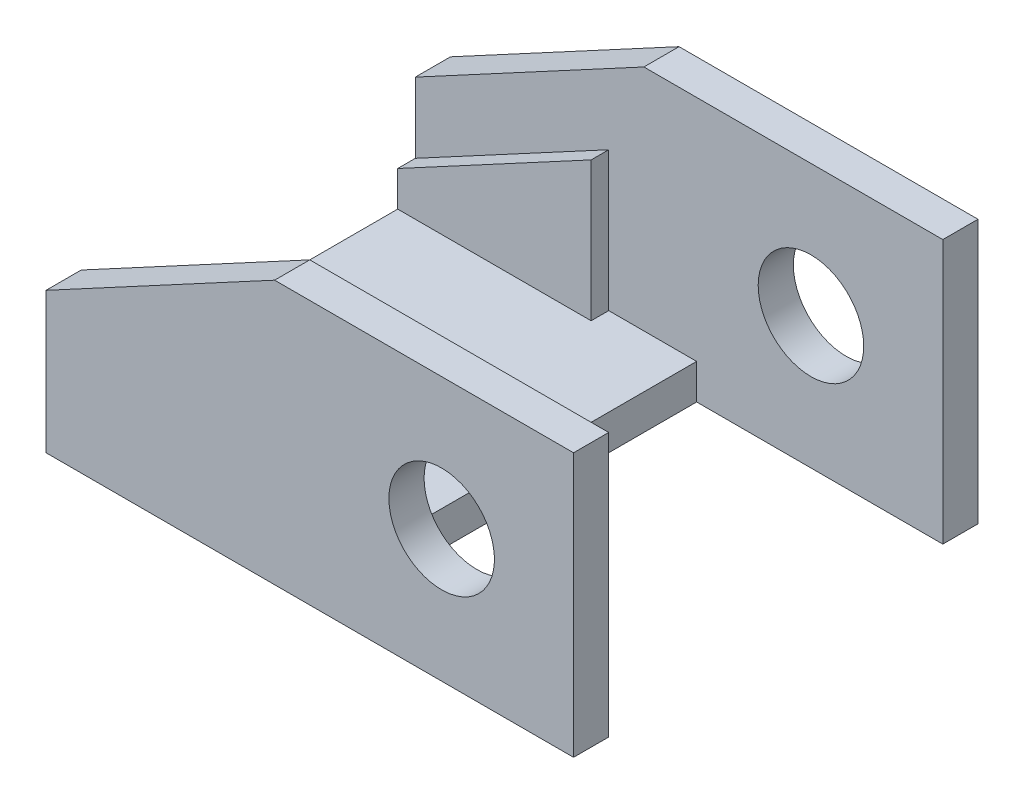
ISO-10303-21;
HEADER;
FILE_DESCRIPTION(('STEP AP214'),'2;1');
FILE_NAME('part.step','',(''),(''),'','','');
FILE_SCHEMA(('AUTOMOTIVE_DESIGN { 1 0 10303 214 1 1 1 1 }'));
ENDSEC;
DATA;
#1=APPLICATION_CONTEXT('core data for automotive mechanical design processes');
#2=APPLICATION_PROTOCOL_DEFINITION('international standard','automotive_design',2000,#1);
#3=PRODUCT_CONTEXT('',#1,'mechanical');
#4=PRODUCT('Part','Part','',(#3));
#5=PRODUCT_RELATED_PRODUCT_CATEGORY('part','',(#4));
#6=PRODUCT_DEFINITION_FORMATION('','',#4);
#7=PRODUCT_DEFINITION_CONTEXT('part definition',#1,'design');
#8=PRODUCT_DEFINITION('design','',#6,#7);
#9=PRODUCT_DEFINITION_SHAPE('','',#8);
#10=(LENGTH_UNIT() NAMED_UNIT(*) SI_UNIT(.MILLI.,.METRE.));
#11=(NAMED_UNIT(*) PLANE_ANGLE_UNIT() SI_UNIT($,.RADIAN.));
#12=(NAMED_UNIT(*) SI_UNIT($,.STERADIAN.) SOLID_ANGLE_UNIT());
#13=UNCERTAINTY_MEASURE_WITH_UNIT(LENGTH_MEASURE(1.E-05),#10,'distance_accuracy_value','');
#14=(GEOMETRIC_REPRESENTATION_CONTEXT(3) GLOBAL_UNCERTAINTY_ASSIGNED_CONTEXT((#13)) GLOBAL_UNIT_ASSIGNED_CONTEXT((#10,
#11,#12)) REPRESENTATION_CONTEXT('',''));
#15=CARTESIAN_POINT('',(0.,0.,0.));
#16=DIRECTION('',(0.,0.,1.));
#17=DIRECTION('',(1.,0.,0.));
#18=AXIS2_PLACEMENT_3D('',#15,#16,#17);
#19=CARTESIAN_POINT('',(8.,15.,-9.5));
#20=DIRECTION('',(0.,0.,1.));
#21=DIRECTION('',(1.,0.,0.));
#22=AXIS2_PLACEMENT_3D('',#19,#20,#21);
#23=PLANE('',#22);
#24=CARTESIAN_POINT('',(14.5,7.5,-9.5));
#25=DIRECTION('',(0.,0.,1.));
#26=DIRECTION('',(1.,0.,0.));
#27=AXIS2_PLACEMENT_3D('',#24,#25,#26);
#28=CIRCLE('',#27,3.);
#29=CARTESIAN_POINT('',(17.5,7.5,-9.5));
#30=VERTEX_POINT('',#29);
#31=EDGE_CURVE('E220',#30,#30,#28,.F.);
#32=ORIENTED_EDGE('',*,*,#31,.T.);
#33=EDGE_LOOP('',(#32));
#34=FACE_BOUND('',#33,.T.);
#35=DIRECTION('',(-0.880471099922175,-0.474099823035017,0.));
#36=VECTOR('',#35,1.);
#37=CARTESIAN_POINT('',(-8.,4.,-9.5));
#38=LINE('',#37,#36);
#39=CARTESIAN_POINT('',(2.99999999999999,9.92307692307692,-9.5));
#40=VERTEX_POINT('',#39);
#41=CARTESIAN_POINT('',(-8.,4.,-9.5));
#42=VERTEX_POINT('',#41);
#43=EDGE_CURVE('E238',#40,#42,#38,.T.);
#44=ORIENTED_EDGE('',*,*,#43,.F.);
#45=DIRECTION('',(0.,1.,0.));
#46=VECTOR('',#45,1.);
#47=CARTESIAN_POINT('',(2.99999999999999,9.92307692307692,-9.5));
#48=LINE('',#47,#46);
#49=CARTESIAN_POINT('',(3.,2.,-9.5));
#50=VERTEX_POINT('',#49);
#51=EDGE_CURVE('E232',#50,#40,#48,.T.);
#52=ORIENTED_EDGE('',*,*,#51,.F.);
#53=DIRECTION('',(-1.,0.,0.));
#54=VECTOR('',#53,1.);
#55=CARTESIAN_POINT('',(-8.,2.,-9.5));
#56=LINE('',#55,#54);
#57=CARTESIAN_POINT('',(8.,2.,-9.5));
#58=VERTEX_POINT('',#57);
#59=EDGE_CURVE('E285',#58,#50,#56,.T.);
#60=ORIENTED_EDGE('',*,*,#59,.F.);
#61=DIRECTION('',(0.,-1.,0.));
#62=VECTOR('',#61,1.);
#63=CARTESIAN_POINT('',(8.,15.,-9.5));
#64=LINE('',#63,#62);
#65=CARTESIAN_POINT('',(8.,0.,-9.5));
#66=VERTEX_POINT('',#65);
#67=EDGE_CURVE('E270',#58,#66,#64,.T.);
#68=ORIENTED_EDGE('',*,*,#67,.T.);
#69=DIRECTION('',(-1.,0.,0.));
#70=VECTOR('',#69,1.);
#71=CARTESIAN_POINT('',(22.,0.,-9.5));
#72=LINE('',#71,#70);
#73=CARTESIAN_POINT('',(22.,0.,-9.5));
#74=VERTEX_POINT('',#73);
#75=EDGE_CURVE('E264',#74,#66,#72,.T.);
#76=ORIENTED_EDGE('',*,*,#75,.F.);
#77=DIRECTION('',(0.,-1.,0.));
#78=VECTOR('',#77,1.);
#79=CARTESIAN_POINT('',(22.,15.,-9.5));
#80=LINE('',#79,#78);
#81=CARTESIAN_POINT('',(22.,15.,-9.5));
#82=VERTEX_POINT('',#81);
#83=EDGE_CURVE('E259',#82,#74,#80,.T.);
#84=ORIENTED_EDGE('',*,*,#83,.F.);
#85=DIRECTION('',(-1.,0.,0.));
#86=VECTOR('',#85,1.);
#87=CARTESIAN_POINT('',(8.,15.,-9.5));
#88=LINE('',#87,#86);
#89=CARTESIAN_POINT('',(5.,15.,-9.5));
#90=VERTEX_POINT('',#89);
#91=EDGE_CURVE('E307',#82,#90,#88,.T.);
#92=ORIENTED_EDGE('',*,*,#91,.T.);
#93=DIRECTION('',(-0.880471099922175,-0.474099823035017,0.));
#94=VECTOR('',#93,1.);
#95=CARTESIAN_POINT('',(7.32568807339449,16.2522935779816,-9.5));
#96=LINE('',#95,#94);
#97=CARTESIAN_POINT('',(-8.,8.,-9.50000000000001));
#98=VERTEX_POINT('',#97);
#99=EDGE_CURVE('E56',#90,#98,#96,.T.);
#100=ORIENTED_EDGE('',*,*,#99,.T.);
#101=DIRECTION('',(0.,-1.,0.));
#102=VECTOR('',#101,1.);
#103=CARTESIAN_POINT('',(-8.,15.,-9.5));
#104=LINE('',#103,#102);
#105=EDGE_CURVE('E298',#98,#42,#104,.T.);
#106=ORIENTED_EDGE('',*,*,#105,.T.);
#107=EDGE_LOOP('',(#44,#52,#60,#68,#76,#84,#92,#100,#106));
#108=FACE_BOUND('',#107,.T.);
#109=ADVANCED_FACE('F33',(#34,#108),#23,.T.);
#110=CARTESIAN_POINT('',(0.,2.,0.));
#111=DIRECTION('',(0.,1.,0.));
#112=DIRECTION('',(0.,0.,1.));
#113=AXIS2_PLACEMENT_3D('',#110,#111,#112);
#114=PLANE('',#113);
#115=CARTESIAN_POINT('',(4.,2.,0.));
#116=DIRECTION('',(0.,1.,0.));
#117=DIRECTION('',(0.,0.,1.));
#118=AXIS2_PLACEMENT_3D('',#115,#116,#117);
#119=CIRCLE('',#118,2.5);
#120=CARTESIAN_POINT('',(4.,2.,2.5));
#121=VERTEX_POINT('',#120);
#122=EDGE_CURVE('E41',#121,#121,#119,.F.);
#123=ORIENTED_EDGE('',*,*,#122,.T.);
#124=EDGE_LOOP('',(#123));
#125=FACE_BOUND('',#124,.T.);
#126=CARTESIAN_POINT('',(-4.,2.,0.));
#127=DIRECTION('',(0.,1.,0.));
#128=DIRECTION('',(0.,0.,1.));
#129=AXIS2_PLACEMENT_3D('',#126,#127,#128);
#130=CIRCLE('',#129,2.50000000000001);
#131=CARTESIAN_POINT('',(-4.,2.,2.50000000000001));
#132=VERTEX_POINT('',#131);
#133=EDGE_CURVE('E447',#132,#132,#130,.F.);
#134=ORIENTED_EDGE('',*,*,#133,.T.);
#135=EDGE_LOOP('',(#134));
#136=FACE_BOUND('',#135,.T.);
#137=ORIENTED_EDGE('',*,*,#59,.T.);
#138=DIRECTION('',(0.,0.,-1.));
#139=VECTOR('',#138,1.);
#140=CARTESIAN_POINT('',(3.,2.,-8.5));
#141=LINE('',#140,#139);
#142=CARTESIAN_POINT('',(3.,2.,-8.5));
#143=VERTEX_POINT('',#142);
#144=EDGE_CURVE('E251',#143,#50,#141,.T.);
#145=ORIENTED_EDGE('',*,*,#144,.F.);
#146=DIRECTION('',(1.,0.,0.));
#147=VECTOR('',#146,1.);
#148=CARTESIAN_POINT('',(3.,2.,-8.5));
#149=LINE('',#148,#147);
#150=CARTESIAN_POINT('',(-8.,2.,-8.5));
#151=VERTEX_POINT('',#150);
#152=EDGE_CURVE('E235',#151,#143,#149,.T.);
#153=ORIENTED_EDGE('',*,*,#152,.F.);
#154=DIRECTION('',(0.,0.,1.));
#155=VECTOR('',#154,1.);
#156=CARTESIAN_POINT('',(-8.,2.,-9.5));
#157=LINE('',#156,#155);
#158=CARTESIAN_POINT('',(-8.,2.,8.5));
#159=VERTEX_POINT('',#158);
#160=EDGE_CURVE('E183',#151,#159,#157,.T.);
#161=ORIENTED_EDGE('',*,*,#160,.T.);
#162=DIRECTION('',(1.,0.,0.));
#163=VECTOR('',#162,1.);
#164=CARTESIAN_POINT('',(3.,2.,8.5));
#165=LINE('',#164,#163);
#166=CARTESIAN_POINT('',(3.,2.,8.5));
#167=VERTEX_POINT('',#166);
#168=EDGE_CURVE('E164',#159,#167,#165,.T.);
#169=ORIENTED_EDGE('',*,*,#168,.T.);
#170=DIRECTION('',(0.,0.,1.));
#171=VECTOR('',#170,1.);
#172=CARTESIAN_POINT('',(3.,2.,8.5));
#173=LINE('',#172,#171);
#174=CARTESIAN_POINT('',(3.,2.,9.5));
#175=VERTEX_POINT('',#174);
#176=EDGE_CURVE('E170',#167,#175,#173,.T.);
#177=ORIENTED_EDGE('',*,*,#176,.T.);
#178=DIRECTION('',(-1.,0.,0.));
#179=VECTOR('',#178,1.);
#180=CARTESIAN_POINT('',(-8.,2.,9.5));
#181=LINE('',#180,#179);
#182=CARTESIAN_POINT('',(8.,2.,9.5));
#183=VERTEX_POINT('',#182);
#184=EDGE_CURVE('E356',#183,#175,#181,.T.);
#185=ORIENTED_EDGE('',*,*,#184,.F.);
#186=DIRECTION('',(0.,0.,-1.));
#187=VECTOR('',#186,1.);
#188=CARTESIAN_POINT('',(8.,2.,-9.5));
#189=LINE('',#188,#187);
#190=EDGE_CURVE('E292',#183,#58,#189,.T.);
#191=ORIENTED_EDGE('',*,*,#190,.T.);
#192=EDGE_LOOP('',(#137,#145,#153,#161,#169,#177,#185,#191));
#193=FACE_BOUND('',#192,.T.);
#194=ADVANCED_FACE('F181',(#125,#136,#193),#114,.T.);
#195=CARTESIAN_POINT('',(8.,2.,-9.5));
#196=DIRECTION('',(-1.,0.,0.));
#197=DIRECTION('',(0.,0.,1.));
#198=AXIS2_PLACEMENT_3D('',#195,#196,#197);
#199=PLANE('',#198);
#200=ORIENTED_EDGE('',*,*,#67,.F.);
#201=ORIENTED_EDGE('',*,*,#190,.F.);
#202=DIRECTION('',(0.,-1.,0.));
#203=VECTOR('',#202,1.);
#204=CARTESIAN_POINT('',(8.,15.,9.5));
#205=LINE('',#204,#203);
#206=CARTESIAN_POINT('',(8.,0.,9.5));
#207=VERTEX_POINT('',#206);
#208=EDGE_CURVE('E216',#183,#207,#205,.T.);
#209=ORIENTED_EDGE('',*,*,#208,.T.);
#210=DIRECTION('',(0.,0.,-1.));
#211=VECTOR('',#210,1.);
#212=CARTESIAN_POINT('',(8.,0.,-9.5));
#213=LINE('',#212,#211);
#214=EDGE_CURVE('E276',#207,#66,#213,.T.);
#215=ORIENTED_EDGE('',*,*,#214,.T.);
#216=EDGE_LOOP('',(#200,#201,#209,#215));
#217=FACE_BOUND('',#216,.T.);
#218=ADVANCED_FACE('F315',(#217),#199,.F.);
#219=CARTESIAN_POINT('',(-8.,2.,-9.5));
#220=DIRECTION('',(1.,0.,0.));
#221=DIRECTION('',(0.,0.,-1.));
#222=AXIS2_PLACEMENT_3D('',#219,#220,#221);
#223=PLANE('',#222);
#224=DIRECTION('',(0.,0.,1.));
#225=VECTOR('',#224,1.);
#226=CARTESIAN_POINT('',(-8.,8.,-42.4549704462802));
#227=LINE('',#226,#225);
#228=CARTESIAN_POINT('',(-8.,8.,-11.5));
#229=VERTEX_POINT('',#228);
#230=EDGE_CURVE('E267',#229,#98,#227,.T.);
#231=ORIENTED_EDGE('',*,*,#230,.F.);
#232=DIRECTION('',(0.,-1.,0.));
#233=VECTOR('',#232,1.);
#234=CARTESIAN_POINT('',(-8.,15.,-11.5));
#235=LINE('',#234,#233);
#236=CARTESIAN_POINT('',(-8.,0.,-11.5));
#237=VERTEX_POINT('',#236);
#238=EDGE_CURVE('E301',#229,#237,#235,.T.);
#239=ORIENTED_EDGE('',*,*,#238,.T.);
#240=DIRECTION('',(0.,0.,1.));
#241=VECTOR('',#240,1.);
#242=CARTESIAN_POINT('',(-8.,0.,-9.5));
#243=LINE('',#242,#241);
#244=CARTESIAN_POINT('',(-8.,0.,11.5));
#245=VERTEX_POINT('',#244);
#246=EDGE_CURVE('E295',#237,#245,#243,.T.);
#247=ORIENTED_EDGE('',*,*,#246,.T.);
#248=DIRECTION('',(0.,-1.,0.));
#249=VECTOR('',#248,1.);
#250=CARTESIAN_POINT('',(-8.,15.,11.5));
#251=LINE('',#250,#249);
#252=CARTESIAN_POINT('',(-8.,8.,11.5));
#253=VERTEX_POINT('',#252);
#254=EDGE_CURVE('E372',#253,#245,#251,.T.);
#255=ORIENTED_EDGE('',*,*,#254,.F.);
#256=DIRECTION('',(0.,0.,-1.));
#257=VECTOR('',#256,1.);
#258=CARTESIAN_POINT('',(-8.,8.,42.4549704462802));
#259=LINE('',#258,#257);
#260=CARTESIAN_POINT('',(-8.,8.,9.50000000000001));
#261=VERTEX_POINT('',#260);
#262=EDGE_CURVE('E213',#253,#261,#259,.T.);
#263=ORIENTED_EDGE('',*,*,#262,.T.);
#264=DIRECTION('',(0.,-1.,0.));
#265=VECTOR('',#264,1.);
#266=CARTESIAN_POINT('',(-8.,15.,9.5));
#267=LINE('',#266,#265);
#268=CARTESIAN_POINT('',(-8.,4.,9.5));
#269=VERTEX_POINT('',#268);
#270=EDGE_CURVE('E222',#261,#269,#267,.T.);
#271=ORIENTED_EDGE('',*,*,#270,.T.);
#272=DIRECTION('',(0.,0.,1.));
#273=VECTOR('',#272,1.);
#274=CARTESIAN_POINT('',(-8.,4.,8.5));
#275=LINE('',#274,#273);
#276=CARTESIAN_POINT('',(-8.,4.,8.5));
#277=VERTEX_POINT('',#276);
#278=EDGE_CURVE('E196',#277,#269,#275,.T.);
#279=ORIENTED_EDGE('',*,*,#278,.F.);
#280=DIRECTION('',(0.,-1.,0.));
#281=VECTOR('',#280,1.);
#282=CARTESIAN_POINT('',(-8.,2.,8.5));
#283=LINE('',#282,#281);
#284=EDGE_CURVE('E194',#277,#159,#283,.T.);
#285=ORIENTED_EDGE('',*,*,#284,.T.);
#286=ORIENTED_EDGE('',*,*,#160,.F.);
#287=DIRECTION('',(0.,-1.,0.));
#288=VECTOR('',#287,1.);
#289=CARTESIAN_POINT('',(-8.,2.,-8.5));
#290=LINE('',#289,#288);
#291=CARTESIAN_POINT('',(-8.,4.,-8.5));
#292=VERTEX_POINT('',#291);
#293=EDGE_CURVE('E48',#292,#151,#290,.T.);
#294=ORIENTED_EDGE('',*,*,#293,.F.);
#295=DIRECTION('',(0.,0.,-1.));
#296=VECTOR('',#295,1.);
#297=CARTESIAN_POINT('',(-8.,4.,-8.5));
#298=LINE('',#297,#296);
#299=EDGE_CURVE('E243',#292,#42,#298,.T.);
#300=ORIENTED_EDGE('',*,*,#299,.T.);
#301=ORIENTED_EDGE('',*,*,#105,.F.);
#302=EDGE_LOOP('',(#231,#239,#247,#255,#263,#271,#279,#285,#286,#294,#300,#301));
#303=FACE_BOUND('',#302,.T.);
#304=ADVANCED_FACE('F347',(#303),#223,.F.);
#305=CARTESIAN_POINT('',(8.,15.,-11.5));
#306=DIRECTION('',(0.,0.,-1.));
#307=DIRECTION('',(-1.,0.,0.));
#308=AXIS2_PLACEMENT_3D('',#305,#306,#307);
#309=PLANE('',#308);
#310=CARTESIAN_POINT('',(14.5,7.5,-11.5));
#311=DIRECTION('',(0.,0.,-1.));
#312=DIRECTION('',(-1.,0.,0.));
#313=AXIS2_PLACEMENT_3D('',#310,#311,#312);
#314=CIRCLE('',#313,3.);
#315=CARTESIAN_POINT('',(11.5,7.5,-11.5));
#316=VERTEX_POINT('',#315);
#317=EDGE_CURVE('E229',#316,#316,#314,.T.);
#318=ORIENTED_EDGE('',*,*,#317,.F.);
#319=EDGE_LOOP('',(#318));
#320=FACE_BOUND('',#319,.T.);
#321=ORIENTED_EDGE('',*,*,#238,.F.);
#322=DIRECTION('',(0.880471099922175,0.474099823035017,0.));
#323=VECTOR('',#322,1.);
#324=CARTESIAN_POINT('',(7.3256880733945,16.2522935779816,-11.5));
#325=LINE('',#324,#323);
#326=CARTESIAN_POINT('',(5.,15.,-11.5));
#327=VERTEX_POINT('',#326);
#328=EDGE_CURVE('E338',#229,#327,#325,.T.);
#329=ORIENTED_EDGE('',*,*,#328,.T.);
#330=DIRECTION('',(1.,0.,0.));
#331=VECTOR('',#330,1.);
#332=CARTESIAN_POINT('',(8.,15.,-11.5));
#333=LINE('',#332,#331);
#334=CARTESIAN_POINT('',(22.,15.,-11.5));
#335=VERTEX_POINT('',#334);
#336=EDGE_CURVE('E336',#327,#335,#333,.T.);
#337=ORIENTED_EDGE('',*,*,#336,.T.);
#338=DIRECTION('',(0.,1.,0.));
#339=VECTOR('',#338,1.);
#340=CARTESIAN_POINT('',(22.,15.,-11.5));
#341=LINE('',#340,#339);
#342=CARTESIAN_POINT('',(22.,0.,-11.5));
#343=VERTEX_POINT('',#342);
#344=EDGE_CURVE('E253',#343,#335,#341,.T.);
#345=ORIENTED_EDGE('',*,*,#344,.F.);
#346=DIRECTION('',(1.,0.,0.));
#347=VECTOR('',#346,1.);
#348=CARTESIAN_POINT('',(8.,0.,-11.5));
#349=LINE('',#348,#347);
#350=EDGE_CURVE('E305',#237,#343,#349,.T.);
#351=ORIENTED_EDGE('',*,*,#350,.F.);
#352=EDGE_LOOP('',(#321,#329,#337,#345,#351));
#353=FACE_BOUND('',#352,.T.);
#354=ADVANCED_FACE('F333',(#320,#353),#309,.T.);
#355=CARTESIAN_POINT('',(0.,15.,0.));
#356=DIRECTION('',(0.,1.,0.));
#357=DIRECTION('',(0.,0.,1.));
#358=AXIS2_PLACEMENT_3D('',#355,#356,#357);
#359=PLANE('',#358);
#360=ORIENTED_EDGE('',*,*,#336,.F.);
#361=DIRECTION('',(0.,0.,1.));
#362=VECTOR('',#361,1.);
#363=CARTESIAN_POINT('',(5.,15.,0.));
#364=LINE('',#363,#362);
#365=EDGE_CURVE('E275',#327,#90,#364,.T.);
#366=ORIENTED_EDGE('',*,*,#365,.T.);
#367=ORIENTED_EDGE('',*,*,#91,.F.);
#368=DIRECTION('',(0.,0.,1.));
#369=VECTOR('',#368,1.);
#370=CARTESIAN_POINT('',(22.,15.,-9.5));
#371=LINE('',#370,#369);
#372=EDGE_CURVE('E256',#335,#82,#371,.T.);
#373=ORIENTED_EDGE('',*,*,#372,.F.);
#374=EDGE_LOOP('',(#360,#366,#367,#373));
#375=FACE_BOUND('',#374,.T.);
#376=ADVANCED_FACE('F341',(#375),#359,.T.);
#377=CARTESIAN_POINT('',(0.,0.,0.));
#378=DIRECTION('',(0.,1.,0.));
#379=DIRECTION('',(0.,0.,1.));
#380=AXIS2_PLACEMENT_3D('',#377,#378,#379);
#381=PLANE('',#380);
#382=CARTESIAN_POINT('',(4.,0.,0.));
#383=DIRECTION('',(0.,1.,0.));
#384=DIRECTION('',(0.,0.,1.));
#385=AXIS2_PLACEMENT_3D('',#382,#383,#384);
#386=CIRCLE('',#385,1.5);
#387=CARTESIAN_POINT('',(4.,0.,1.5));
#388=VERTEX_POINT('',#387);
#389=EDGE_CURVE('E461',#388,#388,#386,.F.);
#390=ORIENTED_EDGE('',*,*,#389,.F.);
#391=EDGE_LOOP('',(#390));
#392=FACE_BOUND('',#391,.T.);
#393=CARTESIAN_POINT('',(-4.,0.,0.));
#394=DIRECTION('',(0.,1.,0.));
#395=DIRECTION('',(0.,0.,1.));
#396=AXIS2_PLACEMENT_3D('',#393,#394,#395);
#397=CIRCLE('',#396,1.5);
#398=CARTESIAN_POINT('',(-4.,0.,1.5));
#399=VERTEX_POINT('',#398);
#400=EDGE_CURVE('E459',#399,#399,#397,.F.);
#401=ORIENTED_EDGE('',*,*,#400,.F.);
#402=EDGE_LOOP('',(#401));
#403=FACE_BOUND('',#402,.T.);
#404=ORIENTED_EDGE('',*,*,#214,.F.);
#405=DIRECTION('',(-1.,0.,0.));
#406=VECTOR('',#405,1.);
#407=CARTESIAN_POINT('',(22.,0.,9.5));
#408=LINE('',#407,#406);
#409=CARTESIAN_POINT('',(22.,0.,9.5));
#410=VERTEX_POINT('',#409);
#411=EDGE_CURVE('E210',#410,#207,#408,.T.);
#412=ORIENTED_EDGE('',*,*,#411,.F.);
#413=DIRECTION('',(0.,0.,1.));
#414=VECTOR('',#413,1.);
#415=CARTESIAN_POINT('',(22.,0.,9.5));
#416=LINE('',#415,#414);
#417=CARTESIAN_POINT('',(22.,0.,11.5));
#418=VERTEX_POINT('',#417);
#419=EDGE_CURVE('E208',#410,#418,#416,.T.);
#420=ORIENTED_EDGE('',*,*,#419,.T.);
#421=DIRECTION('',(1.,0.,0.));
#422=VECTOR('',#421,1.);
#423=CARTESIAN_POINT('',(8.,0.,11.5));
#424=LINE('',#423,#422);
#425=EDGE_CURVE('E364',#245,#418,#424,.T.);
#426=ORIENTED_EDGE('',*,*,#425,.F.);
#427=ORIENTED_EDGE('',*,*,#246,.F.);
#428=ORIENTED_EDGE('',*,*,#350,.T.);
#429=DIRECTION('',(0.,0.,-1.));
#430=VECTOR('',#429,1.);
#431=CARTESIAN_POINT('',(22.,0.,-9.5));
#432=LINE('',#431,#430);
#433=EDGE_CURVE('E261',#74,#343,#432,.T.);
#434=ORIENTED_EDGE('',*,*,#433,.F.);
#435=ORIENTED_EDGE('',*,*,#75,.T.);
#436=EDGE_LOOP('',(#404,#412,#420,#426,#427,#428,#434,#435));
#437=FACE_BOUND('',#436,.T.);
#438=ADVANCED_FACE('F326',(#392,#403,#437),#381,.F.);
#439=CARTESIAN_POINT('',(5.,15.,-42.4549704462802));
#440=DIRECTION('',(-0.474099823035017,0.880471099922175,0.));
#441=DIRECTION('',(-0.880471099922175,-0.474099823035017,0.));
#442=AXIS2_PLACEMENT_3D('',#439,#440,#441);
#443=PLANE('',#442);
#444=ORIENTED_EDGE('',*,*,#99,.F.);
#445=ORIENTED_EDGE('',*,*,#365,.F.);
#446=ORIENTED_EDGE('',*,*,#328,.F.);
#447=ORIENTED_EDGE('',*,*,#230,.T.);
#448=EDGE_LOOP('',(#444,#445,#446,#447));
#449=FACE_BOUND('',#448,.T.);
#450=ADVANCED_FACE('F346',(#449),#443,.T.);
#451=CARTESIAN_POINT('',(22.,0.,0.));
#452=DIRECTION('',(1.,0.,0.));
#453=DIRECTION('',(0.,0.,-1.));
#454=AXIS2_PLACEMENT_3D('',#451,#452,#453);
#455=PLANE('',#454);
#456=ORIENTED_EDGE('',*,*,#344,.T.);
#457=ORIENTED_EDGE('',*,*,#372,.T.);
#458=ORIENTED_EDGE('',*,*,#83,.T.);
#459=ORIENTED_EDGE('',*,*,#433,.T.);
#460=EDGE_LOOP('',(#456,#457,#458,#459));
#461=FACE_BOUND('',#460,.T.);
#462=ADVANCED_FACE('F330',(#461),#455,.T.);
#463=CARTESIAN_POINT('',(2.99999999999999,9.92307692307692,-8.5));
#464=DIRECTION('',(-1.,0.,0.));
#465=DIRECTION('',(0.,-1.,0.));
#466=AXIS2_PLACEMENT_3D('',#463,#464,#465);
#467=PLANE('',#466);
#468=ORIENTED_EDGE('',*,*,#51,.T.);
#469=DIRECTION('',(0.,0.,-1.));
#470=VECTOR('',#469,1.);
#471=CARTESIAN_POINT('',(2.99999999999999,9.92307692307692,-8.5));
#472=LINE('',#471,#470);
#473=CARTESIAN_POINT('',(2.99999999999999,9.92307692307692,-8.5));
#474=VERTEX_POINT('',#473);
#475=EDGE_CURVE('E248',#474,#40,#472,.T.);
#476=ORIENTED_EDGE('',*,*,#475,.F.);
#477=DIRECTION('',(0.,1.,0.));
#478=VECTOR('',#477,1.);
#479=CARTESIAN_POINT('',(2.99999999999999,9.92307692307692,-8.5));
#480=LINE('',#479,#478);
#481=EDGE_CURVE('E237',#143,#474,#480,.T.);
#482=ORIENTED_EDGE('',*,*,#481,.F.);
#483=ORIENTED_EDGE('',*,*,#144,.T.);
#484=EDGE_LOOP('',(#468,#476,#482,#483));
#485=FACE_BOUND('',#484,.T.);
#486=ADVANCED_FACE('F354',(#485),#467,.F.);
#487=CARTESIAN_POINT('',(-8.,4.,-8.5));
#488=DIRECTION('',(0.474099823035017,-0.880471099922175,0.));
#489=DIRECTION('',(0.880471099922175,0.474099823035018,0.));
#490=AXIS2_PLACEMENT_3D('',#487,#488,#489);
#491=PLANE('',#490);
#492=ORIENTED_EDGE('',*,*,#43,.T.);
#493=ORIENTED_EDGE('',*,*,#299,.F.);
#494=DIRECTION('',(-0.880471099922175,-0.474099823035017,0.));
#495=VECTOR('',#494,1.);
#496=CARTESIAN_POINT('',(-8.,4.,-8.5));
#497=LINE('',#496,#495);
#498=EDGE_CURVE('E240',#474,#292,#497,.T.);
#499=ORIENTED_EDGE('',*,*,#498,.F.);
#500=ORIENTED_EDGE('',*,*,#475,.T.);
#501=EDGE_LOOP('',(#492,#493,#499,#500));
#502=FACE_BOUND('',#501,.T.);
#503=ADVANCED_FACE('F350',(#502),#491,.F.);
#504=CARTESIAN_POINT('',(0.,0.,-8.5));
#505=DIRECTION('',(0.,0.,-1.));
#506=DIRECTION('',(-1.,0.,0.));
#507=AXIS2_PLACEMENT_3D('',#504,#505,#506);
#508=PLANE('',#507);
#509=ORIENTED_EDGE('',*,*,#152,.T.);
#510=ORIENTED_EDGE('',*,*,#481,.T.);
#511=ORIENTED_EDGE('',*,*,#498,.T.);
#512=ORIENTED_EDGE('',*,*,#293,.T.);
#513=EDGE_LOOP('',(#509,#510,#511,#512));
#514=FACE_BOUND('',#513,.T.);
#515=ADVANCED_FACE('F485',(#514),#508,.F.);
#516=CARTESIAN_POINT('',(14.5,7.5,0.00102500000000172));
#517=DIRECTION('',(0.,0.,-1.));
#518=DIRECTION('',(-1.,0.,0.));
#519=AXIS2_PLACEMENT_3D('',#516,#517,#518);
#520=CYLINDRICAL_SURFACE('',#519,3.);
#521=ORIENTED_EDGE('',*,*,#31,.F.);
#522=EDGE_LOOP('',(#521));
#523=FACE_BOUND('',#522,.T.);
#524=ORIENTED_EDGE('',*,*,#317,.T.);
#525=EDGE_LOOP('',(#524));
#526=FACE_BOUND('',#525,.T.);
#527=ADVANCED_FACE('F478',(#523,#526),#520,.F.);
#528=CARTESIAN_POINT('',(8.,15.,9.5));
#529=DIRECTION('',(0.,0.,-1.));
#530=DIRECTION('',(1.,0.,0.));
#531=AXIS2_PLACEMENT_3D('',#528,#529,#530);
#532=PLANE('',#531);
#533=CARTESIAN_POINT('',(14.5,7.5,9.5));
#534=DIRECTION('',(0.,0.,1.));
#535=DIRECTION('',(1.,0.,0.));
#536=AXIS2_PLACEMENT_3D('',#533,#534,#535);
#537=CIRCLE('',#536,3.);
#538=CARTESIAN_POINT('',(17.5,7.5,9.5));
#539=VERTEX_POINT('',#538);
#540=EDGE_CURVE('E190',#539,#539,#537,.F.);
#541=ORIENTED_EDGE('',*,*,#540,.F.);
#542=EDGE_LOOP('',(#541));
#543=FACE_BOUND('',#542,.T.);
#544=DIRECTION('',(-0.880471099922175,-0.474099823035017,0.));
#545=VECTOR('',#544,1.);
#546=CARTESIAN_POINT('',(-8.,4.,9.5));
#547=LINE('',#546,#545);
#548=CARTESIAN_POINT('',(2.99999999999999,9.92307692307692,9.5));
#549=VERTEX_POINT('',#548);
#550=EDGE_CURVE('E185',#549,#269,#547,.T.);
#551=ORIENTED_EDGE('',*,*,#550,.T.);
#552=ORIENTED_EDGE('',*,*,#270,.F.);
#553=DIRECTION('',(-0.880471099922175,-0.474099823035017,0.));
#554=VECTOR('',#553,1.);
#555=CARTESIAN_POINT('',(7.32568807339449,16.2522935779816,9.5));
#556=LINE('',#555,#554);
#557=CARTESIAN_POINT('',(5.,15.,9.5));
#558=VERTEX_POINT('',#557);
#559=EDGE_CURVE('E374',#558,#261,#556,.T.);
#560=ORIENTED_EDGE('',*,*,#559,.F.);
#561=DIRECTION('',(-1.,0.,0.));
#562=VECTOR('',#561,1.);
#563=CARTESIAN_POINT('',(8.,15.,9.5));
#564=LINE('',#563,#562);
#565=CARTESIAN_POINT('',(22.,15.,9.5));
#566=VERTEX_POINT('',#565);
#567=EDGE_CURVE('E376',#566,#558,#564,.T.);
#568=ORIENTED_EDGE('',*,*,#567,.F.);
#569=DIRECTION('',(0.,-1.,0.));
#570=VECTOR('',#569,1.);
#571=CARTESIAN_POINT('',(22.,15.,9.5));
#572=LINE('',#571,#570);
#573=EDGE_CURVE('E205',#566,#410,#572,.T.);
#574=ORIENTED_EDGE('',*,*,#573,.T.);
#575=ORIENTED_EDGE('',*,*,#411,.T.);
#576=ORIENTED_EDGE('',*,*,#208,.F.);
#577=ORIENTED_EDGE('',*,*,#184,.T.);
#578=DIRECTION('',(0.,1.,0.));
#579=VECTOR('',#578,1.);
#580=CARTESIAN_POINT('',(2.99999999999999,9.92307692307692,9.5));
#581=LINE('',#580,#579);
#582=EDGE_CURVE('E173',#175,#549,#581,.T.);
#583=ORIENTED_EDGE('',*,*,#582,.T.);
#584=EDGE_LOOP('',(#551,#552,#560,#568,#574,#575,#576,#577,#583));
#585=FACE_BOUND('',#584,.T.);
#586=ADVANCED_FACE('F359',(#543,#585),#532,.T.);
#587=CARTESIAN_POINT('',(8.,15.,11.5));
#588=DIRECTION('',(0.,0.,1.));
#589=DIRECTION('',(-1.,0.,0.));
#590=AXIS2_PLACEMENT_3D('',#587,#588,#589);
#591=PLANE('',#590);
#592=CARTESIAN_POINT('',(14.5,7.5,11.5));
#593=DIRECTION('',(0.,0.,-1.));
#594=DIRECTION('',(-1.,0.,0.));
#595=AXIS2_PLACEMENT_3D('',#592,#593,#594);
#596=CIRCLE('',#595,3.);
#597=CARTESIAN_POINT('',(11.5,7.5,11.5));
#598=VERTEX_POINT('',#597);
#599=EDGE_CURVE('E197',#598,#598,#596,.T.);
#600=ORIENTED_EDGE('',*,*,#599,.T.);
#601=EDGE_LOOP('',(#600));
#602=FACE_BOUND('',#601,.T.);
#603=ORIENTED_EDGE('',*,*,#254,.T.);
#604=ORIENTED_EDGE('',*,*,#425,.T.);
#605=DIRECTION('',(0.,1.,0.));
#606=VECTOR('',#605,1.);
#607=CARTESIAN_POINT('',(22.,15.,11.5));
#608=LINE('',#607,#606);
#609=CARTESIAN_POINT('',(22.,15.,11.5));
#610=VERTEX_POINT('',#609);
#611=EDGE_CURVE('E177',#418,#610,#608,.T.);
#612=ORIENTED_EDGE('',*,*,#611,.T.);
#613=DIRECTION('',(1.,0.,0.));
#614=VECTOR('',#613,1.);
#615=CARTESIAN_POINT('',(8.,15.,11.5));
#616=LINE('',#615,#614);
#617=CARTESIAN_POINT('',(5.,15.,11.5));
#618=VERTEX_POINT('',#617);
#619=EDGE_CURVE('E373',#618,#610,#616,.T.);
#620=ORIENTED_EDGE('',*,*,#619,.F.);
#621=DIRECTION('',(0.880471099922175,0.474099823035017,0.));
#622=VECTOR('',#621,1.);
#623=CARTESIAN_POINT('',(7.3256880733945,16.2522935779816,11.5));
#624=LINE('',#623,#622);
#625=EDGE_CURVE('E379',#253,#618,#624,.T.);
#626=ORIENTED_EDGE('',*,*,#625,.F.);
#627=EDGE_LOOP('',(#603,#604,#612,#620,#626));
#628=FACE_BOUND('',#627,.T.);
#629=ADVANCED_FACE('F371',(#602,#628),#591,.T.);
#630=CARTESIAN_POINT('',(0.,15.,0.));
#631=DIRECTION('',(0.,1.,0.));
#632=DIRECTION('',(0.,0.,-1.));
#633=AXIS2_PLACEMENT_3D('',#630,#631,#632);
#634=PLANE('',#633);
#635=ORIENTED_EDGE('',*,*,#619,.T.);
#636=DIRECTION('',(0.,0.,-1.));
#637=VECTOR('',#636,1.);
#638=CARTESIAN_POINT('',(22.,15.,9.5));
#639=LINE('',#638,#637);
#640=EDGE_CURVE('E203',#610,#566,#639,.T.);
#641=ORIENTED_EDGE('',*,*,#640,.T.);
#642=ORIENTED_EDGE('',*,*,#567,.T.);
#643=DIRECTION('',(0.,0.,-1.));
#644=VECTOR('',#643,1.);
#645=CARTESIAN_POINT('',(5.,15.,0.));
#646=LINE('',#645,#644);
#647=EDGE_CURVE('E221',#618,#558,#646,.T.);
#648=ORIENTED_EDGE('',*,*,#647,.F.);
#649=EDGE_LOOP('',(#635,#641,#642,#648));
#650=FACE_BOUND('',#649,.T.);
#651=ADVANCED_FACE('F394',(#650),#634,.T.);
#652=CARTESIAN_POINT('',(5.,15.,42.4549704462802));
#653=DIRECTION('',(-0.474099823035017,0.880471099922175,0.));
#654=DIRECTION('',(-0.880471099922175,-0.474099823035017,0.));
#655=AXIS2_PLACEMENT_3D('',#652,#653,#654);
#656=PLANE('',#655);
#657=ORIENTED_EDGE('',*,*,#559,.T.);
#658=ORIENTED_EDGE('',*,*,#262,.F.);
#659=ORIENTED_EDGE('',*,*,#625,.T.);
#660=ORIENTED_EDGE('',*,*,#647,.T.);
#661=EDGE_LOOP('',(#657,#658,#659,#660));
#662=FACE_BOUND('',#661,.T.);
#663=ADVANCED_FACE('F389',(#662),#656,.T.);
#664=CARTESIAN_POINT('',(22.,0.,0.));
#665=DIRECTION('',(1.,0.,0.));
#666=DIRECTION('',(0.,0.,1.));
#667=AXIS2_PLACEMENT_3D('',#664,#665,#666);
#668=PLANE('',#667);
#669=ORIENTED_EDGE('',*,*,#611,.F.);
#670=ORIENTED_EDGE('',*,*,#419,.F.);
#671=ORIENTED_EDGE('',*,*,#573,.F.);
#672=ORIENTED_EDGE('',*,*,#640,.F.);
#673=EDGE_LOOP('',(#669,#670,#671,#672));
#674=FACE_BOUND('',#673,.T.);
#675=ADVANCED_FACE('F367',(#674),#668,.T.);
#676=CARTESIAN_POINT('',(2.99999999999999,9.92307692307692,8.5));
#677=DIRECTION('',(-1.,0.,0.));
#678=DIRECTION('',(0.,-1.,0.));
#679=AXIS2_PLACEMENT_3D('',#676,#677,#678);
#680=PLANE('',#679);
#681=ORIENTED_EDGE('',*,*,#582,.F.);
#682=ORIENTED_EDGE('',*,*,#176,.F.);
#683=DIRECTION('',(0.,1.,0.));
#684=VECTOR('',#683,1.);
#685=CARTESIAN_POINT('',(2.99999999999999,9.92307692307692,8.5));
#686=LINE('',#685,#684);
#687=CARTESIAN_POINT('',(2.99999999999999,9.92307692307692,8.5));
#688=VERTEX_POINT('',#687);
#689=EDGE_CURVE('E159',#167,#688,#686,.T.);
#690=ORIENTED_EDGE('',*,*,#689,.T.);
#691=DIRECTION('',(0.,0.,1.));
#692=VECTOR('',#691,1.);
#693=CARTESIAN_POINT('',(2.99999999999999,9.92307692307692,8.5));
#694=LINE('',#693,#692);
#695=EDGE_CURVE('E178',#688,#549,#694,.T.);
#696=ORIENTED_EDGE('',*,*,#695,.T.);
#697=EDGE_LOOP('',(#681,#682,#690,#696));
#698=FACE_BOUND('',#697,.T.);
#699=ADVANCED_FACE('F171',(#698),#680,.F.);
#700=CARTESIAN_POINT('',(-8.,4.,8.5));
#701=DIRECTION('',(0.474099823035017,-0.880471099922175,0.));
#702=DIRECTION('',(0.880471099922175,0.474099823035018,0.));
#703=AXIS2_PLACEMENT_3D('',#700,#701,#702);
#704=PLANE('',#703);
#705=ORIENTED_EDGE('',*,*,#550,.F.);
#706=ORIENTED_EDGE('',*,*,#695,.F.);
#707=DIRECTION('',(-0.880471099922175,-0.474099823035017,0.));
#708=VECTOR('',#707,1.);
#709=CARTESIAN_POINT('',(-8.,4.,8.5));
#710=LINE('',#709,#708);
#711=EDGE_CURVE('E165',#688,#277,#710,.T.);
#712=ORIENTED_EDGE('',*,*,#711,.T.);
#713=ORIENTED_EDGE('',*,*,#278,.T.);
#714=EDGE_LOOP('',(#705,#706,#712,#713));
#715=FACE_BOUND('',#714,.T.);
#716=ADVANCED_FACE('F399',(#715),#704,.F.);
#717=CARTESIAN_POINT('',(0.,0.,8.5));
#718=DIRECTION('',(0.,0.,1.));
#719=DIRECTION('',(-1.,0.,0.));
#720=AXIS2_PLACEMENT_3D('',#717,#718,#719);
#721=PLANE('',#720);
#722=ORIENTED_EDGE('',*,*,#168,.F.);
#723=ORIENTED_EDGE('',*,*,#284,.F.);
#724=ORIENTED_EDGE('',*,*,#711,.F.);
#725=ORIENTED_EDGE('',*,*,#689,.F.);
#726=EDGE_LOOP('',(#722,#723,#724,#725));
#727=FACE_BOUND('',#726,.T.);
#728=ADVANCED_FACE('F161',(#727),#721,.F.);
#729=CARTESIAN_POINT('',(14.5,7.5,-0.00102500000000172));
#730=DIRECTION('',(0.,0.,1.));
#731=DIRECTION('',(-1.,0.,0.));
#732=AXIS2_PLACEMENT_3D('',#729,#730,#731);
#733=CYLINDRICAL_SURFACE('',#732,3.);
#734=ORIENTED_EDGE('',*,*,#540,.T.);
#735=EDGE_LOOP('',(#734));
#736=FACE_BOUND('',#735,.T.);
#737=ORIENTED_EDGE('',*,*,#599,.F.);
#738=EDGE_LOOP('',(#737));
#739=FACE_BOUND('',#738,.T.);
#740=ADVANCED_FACE('F406',(#736,#739),#733,.F.);
#741=CARTESIAN_POINT('',(-4.,-0.00104999999999984,0.));
#742=DIRECTION('',(0.,1.,0.));
#743=DIRECTION('',(0.,0.,1.));
#744=AXIS2_PLACEMENT_3D('',#741,#742,#743);
#745=CYLINDRICAL_SURFACE('',#744,1.5);
#746=CARTESIAN_POINT('',(-4.,0.267949192431123,0.));
#747=DIRECTION('',(0.,1.,0.));
#748=DIRECTION('',(0.,0.,1.));
#749=AXIS2_PLACEMENT_3D('',#746,#747,#748);
#750=CIRCLE('',#749,1.5);
#751=CARTESIAN_POINT('',(-4.,0.267949192431123,1.5));
#752=VERTEX_POINT('',#751);
#753=EDGE_CURVE('E11',#752,#752,#750,.T.);
#754=ORIENTED_EDGE('',*,*,#753,.T.);
#755=EDGE_LOOP('',(#754));
#756=FACE_BOUND('',#755,.T.);
#757=ORIENTED_EDGE('',*,*,#400,.T.);
#758=EDGE_LOOP('',(#757));
#759=FACE_BOUND('',#758,.T.);
#760=ADVANCED_FACE('F439',(#756,#759),#745,.F.);
#761=CARTESIAN_POINT('',(4.,-0.00104999999999984,0.));
#762=DIRECTION('',(0.,1.,0.));
#763=DIRECTION('',(0.,0.,1.));
#764=AXIS2_PLACEMENT_3D('',#761,#762,#763);
#765=CYLINDRICAL_SURFACE('',#764,1.5);
#766=CARTESIAN_POINT('',(4.,0.267949192431122,0.));
#767=DIRECTION('',(0.,1.,0.));
#768=DIRECTION('',(0.,0.,1.));
#769=AXIS2_PLACEMENT_3D('',#766,#767,#768);
#770=CIRCLE('',#769,1.5);
#771=CARTESIAN_POINT('',(4.,0.267949192431122,1.5));
#772=VERTEX_POINT('',#771);
#773=EDGE_CURVE('E274',#772,#772,#770,.T.);
#774=ORIENTED_EDGE('',*,*,#773,.T.);
#775=EDGE_LOOP('',(#774));
#776=FACE_BOUND('',#775,.T.);
#777=ORIENTED_EDGE('',*,*,#389,.T.);
#778=EDGE_LOOP('',(#777));
#779=FACE_BOUND('',#778,.T.);
#780=ADVANCED_FACE('F432',(#776,#779),#765,.F.);
#781=CARTESIAN_POINT('',(4.,0.267949192431122,0.));
#782=DIRECTION('',(0.,1.,0.));
#783=DIRECTION('',(0.,0.,1.));
#784=AXIS2_PLACEMENT_3D('',#781,#782,#783);
#785=CONICAL_SURFACE('',#784,1.5,0.523598775598298);
#786=ORIENTED_EDGE('',*,*,#122,.F.);
#787=EDGE_LOOP('',(#786));
#788=FACE_BOUND('',#787,.T.);
#789=ORIENTED_EDGE('',*,*,#773,.F.);
#790=EDGE_LOOP('',(#789));
#791=FACE_BOUND('',#790,.T.);
#792=ADVANCED_FACE('F430',(#788,#791),#785,.F.);
#793=CARTESIAN_POINT('',(-4.,0.267949192431123,0.));
#794=DIRECTION('',(0.,1.,0.));
#795=DIRECTION('',(0.,0.,1.));
#796=AXIS2_PLACEMENT_3D('',#793,#794,#795);
#797=CONICAL_SURFACE('',#796,1.5,0.523598775598301);
#798=ORIENTED_EDGE('',*,*,#133,.F.);
#799=EDGE_LOOP('',(#798));
#800=FACE_BOUND('',#799,.T.);
#801=ORIENTED_EDGE('',*,*,#753,.F.);
#802=EDGE_LOOP('',(#801));
#803=FACE_BOUND('',#802,.T.);
#804=ADVANCED_FACE('F35',(#800,#803),#797,.F.);
#805=CLOSED_SHELL('',(#109,#194,#218,#304,#354,#376,#438,#450,#462,#486,#503,#515,#527,#586,
#629,#651,#663,#675,#699,#716,#728,#740,#760,#780,#792,#804));
#806=MANIFOLD_SOLID_BREP('B2',#805);
#807=ADVANCED_BREP_SHAPE_REPRESENTATION('',(#18,#806),#14);
#808=SHAPE_DEFINITION_REPRESENTATION(#9,#807);
ENDSEC;
END-ISO-10303-21;
